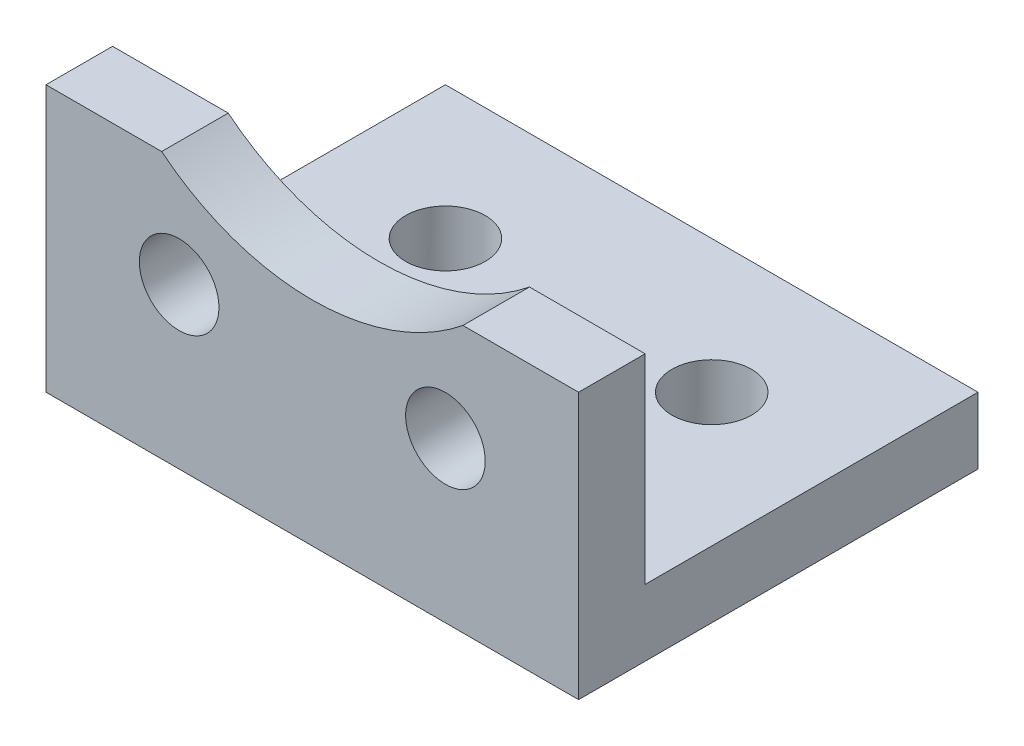
ISO-10303-21;
HEADER;
FILE_DESCRIPTION(('STEP AP214'),'2;1');
FILE_NAME('part.step','',(''),(''),'','','');
FILE_SCHEMA(('AUTOMOTIVE_DESIGN { 1 0 10303 214 1 1 1 1 }'));
ENDSEC;
DATA;
#1=APPLICATION_CONTEXT('core data for automotive mechanical design processes');
#2=APPLICATION_PROTOCOL_DEFINITION('international standard','automotive_design',2000,#1);
#3=PRODUCT_CONTEXT('',#1,'mechanical');
#4=PRODUCT('Part','Part','',(#3));
#5=PRODUCT_RELATED_PRODUCT_CATEGORY('part','',(#4));
#6=PRODUCT_DEFINITION_FORMATION('','',#4);
#7=PRODUCT_DEFINITION_CONTEXT('part definition',#1,'design');
#8=PRODUCT_DEFINITION('design','',#6,#7);
#9=PRODUCT_DEFINITION_SHAPE('','',#8);
#10=(LENGTH_UNIT() NAMED_UNIT(*) SI_UNIT(.MILLI.,.METRE.));
#11=(NAMED_UNIT(*) PLANE_ANGLE_UNIT() SI_UNIT($,.RADIAN.));
#12=(NAMED_UNIT(*) SI_UNIT($,.STERADIAN.) SOLID_ANGLE_UNIT());
#13=UNCERTAINTY_MEASURE_WITH_UNIT(LENGTH_MEASURE(1.E-05),#10,'distance_accuracy_value','');
#14=(GEOMETRIC_REPRESENTATION_CONTEXT(3) GLOBAL_UNCERTAINTY_ASSIGNED_CONTEXT((#13)) GLOBAL_UNIT_ASSIGNED_CONTEXT((#10,
#11,#12)) REPRESENTATION_CONTEXT('',''));
#15=CARTESIAN_POINT('',(0.,0.,0.));
#16=DIRECTION('',(0.,0.,1.));
#17=DIRECTION('',(1.,0.,0.));
#18=AXIS2_PLACEMENT_3D('',#15,#16,#17);
#19=CARTESIAN_POINT('',(12.7,12.7,0.));
#20=DIRECTION('',(0.,1.,0.));
#21=DIRECTION('',(0.,0.,1.));
#22=AXIS2_PLACEMENT_3D('',#19,#20,#21);
#23=PLANE('',#22);
#24=DIRECTION('',(0.,0.,-1.));
#25=VECTOR('',#24,1.);
#26=CARTESIAN_POINT('',(7.18420489685532,12.7,0.));
#27=LINE('',#26,#25);
#28=CARTESIAN_POINT('',(7.18420489685532,12.7,0.));
#29=VERTEX_POINT('',#28);
#30=CARTESIAN_POINT('',(7.18420489685532,12.7,-3.175));
#31=VERTEX_POINT('',#30);
#32=EDGE_CURVE('E100',#29,#31,#27,.T.);
#33=ORIENTED_EDGE('',*,*,#32,.F.);
#34=DIRECTION('',(-1.,0.,0.));
#35=VECTOR('',#34,1.);
#36=CARTESIAN_POINT('',(12.7,12.7,0.));
#37=LINE('',#36,#35);
#38=CARTESIAN_POINT('',(12.7,12.7,0.));
#39=VERTEX_POINT('',#38);
#40=EDGE_CURVE('E110',#39,#29,#37,.T.);
#41=ORIENTED_EDGE('',*,*,#40,.F.);
#42=DIRECTION('',(0.,0.,-1.));
#43=VECTOR('',#42,1.);
#44=CARTESIAN_POINT('',(12.7,12.7,0.));
#45=LINE('',#44,#43);
#46=CARTESIAN_POINT('',(12.7,12.7,-3.175));
#47=VERTEX_POINT('',#46);
#48=EDGE_CURVE('E164',#39,#47,#45,.T.);
#49=ORIENTED_EDGE('',*,*,#48,.T.);
#50=DIRECTION('',(-1.,0.,0.));
#51=VECTOR('',#50,1.);
#52=CARTESIAN_POINT('',(12.7,12.7,-3.175));
#53=LINE('',#52,#51);
#54=EDGE_CURVE('E112',#47,#31,#53,.T.);
#55=ORIENTED_EDGE('',*,*,#54,.T.);
#56=EDGE_LOOP('',(#33,#41,#49,#55));
#57=FACE_BOUND('',#56,.T.);
#58=ADVANCED_FACE('F34',(#57),#23,.T.);
#59=CARTESIAN_POINT('',(12.7,0.,-19.05));
#60=DIRECTION('',(0.,-1.,0.));
#61=DIRECTION('',(0.,0.,-1.));
#62=AXIS2_PLACEMENT_3D('',#59,#60,#61);
#63=PLANE('',#62);
#64=CARTESIAN_POINT('',(6.35,0.,-12.7));
#65=DIRECTION('',(0.,-1.,0.));
#66=DIRECTION('',(0.,0.,-1.));
#67=AXIS2_PLACEMENT_3D('',#64,#65,#66);
#68=CIRCLE('',#67,1.89865);
#69=CARTESIAN_POINT('',(6.35,0.,-14.59865));
#70=VERTEX_POINT('',#69);
#71=EDGE_CURVE('E203',#70,#70,#68,.T.);
#72=ORIENTED_EDGE('',*,*,#71,.F.);
#73=EDGE_LOOP('',(#72));
#74=FACE_BOUND('',#73,.T.);
#75=CARTESIAN_POINT('',(-6.35,0.,-12.7));
#76=DIRECTION('',(0.,-1.,0.));
#77=DIRECTION('',(0.,0.,-1.));
#78=AXIS2_PLACEMENT_3D('',#75,#76,#77);
#79=CIRCLE('',#78,1.89865);
#80=CARTESIAN_POINT('',(-6.35,0.,-14.59865));
#81=VERTEX_POINT('',#80);
#82=EDGE_CURVE('E138',#81,#81,#79,.T.);
#83=ORIENTED_EDGE('',*,*,#82,.F.);
#84=EDGE_LOOP('',(#83));
#85=FACE_BOUND('',#84,.T.);
#86=DIRECTION('',(-1.,0.,0.));
#87=VECTOR('',#86,1.);
#88=CARTESIAN_POINT('',(12.7,0.,0.));
#89=LINE('',#88,#87);
#90=CARTESIAN_POINT('',(12.7,0.,0.));
#91=VERTEX_POINT('',#90);
#92=CARTESIAN_POINT('',(-12.7,0.,0.));
#93=VERTEX_POINT('',#92);
#94=EDGE_CURVE('E124',#91,#93,#89,.T.);
#95=ORIENTED_EDGE('',*,*,#94,.T.);
#96=DIRECTION('',(0.,0.,1.));
#97=VECTOR('',#96,1.);
#98=CARTESIAN_POINT('',(-12.7,0.,-19.05));
#99=LINE('',#98,#97);
#100=CARTESIAN_POINT('',(-12.7,0.,-19.05));
#101=VERTEX_POINT('',#100);
#102=EDGE_CURVE('E130',#101,#93,#99,.T.);
#103=ORIENTED_EDGE('',*,*,#102,.F.);
#104=DIRECTION('',(-1.,0.,0.));
#105=VECTOR('',#104,1.);
#106=CARTESIAN_POINT('',(12.7,0.,-19.05));
#107=LINE('',#106,#105);
#108=CARTESIAN_POINT('',(12.7,0.,-19.05));
#109=VERTEX_POINT('',#108);
#110=EDGE_CURVE('E11',#109,#101,#107,.T.);
#111=ORIENTED_EDGE('',*,*,#110,.F.);
#112=DIRECTION('',(0.,0.,1.));
#113=VECTOR('',#112,1.);
#114=CARTESIAN_POINT('',(12.7,0.,-19.05));
#115=LINE('',#114,#113);
#116=EDGE_CURVE('E161',#109,#91,#115,.T.);
#117=ORIENTED_EDGE('',*,*,#116,.T.);
#118=EDGE_LOOP('',(#95,#103,#111,#117));
#119=FACE_BOUND('',#118,.T.);
#120=ADVANCED_FACE('F36',(#74,#85,#119),#63,.T.);
#121=CARTESIAN_POINT('',(12.7,3.175,-19.05));
#122=DIRECTION('',(0.,0.,-1.));
#123=DIRECTION('',(-1.,0.,0.));
#124=AXIS2_PLACEMENT_3D('',#121,#122,#123);
#125=PLANE('',#124);
#126=ORIENTED_EDGE('',*,*,#110,.T.);
#127=DIRECTION('',(0.,-1.,0.));
#128=VECTOR('',#127,1.);
#129=CARTESIAN_POINT('',(-12.7,3.175,-19.05));
#130=LINE('',#129,#128);
#131=CARTESIAN_POINT('',(-12.7,3.175,-19.05));
#132=VERTEX_POINT('',#131);
#133=EDGE_CURVE('E158',#132,#101,#130,.T.);
#134=ORIENTED_EDGE('',*,*,#133,.F.);
#135=DIRECTION('',(-1.,0.,0.));
#136=VECTOR('',#135,1.);
#137=CARTESIAN_POINT('',(12.7,3.175,-19.05));
#138=LINE('',#137,#136);
#139=CARTESIAN_POINT('',(12.7,3.175,-19.05));
#140=VERTEX_POINT('',#139);
#141=EDGE_CURVE('E43',#140,#132,#138,.T.);
#142=ORIENTED_EDGE('',*,*,#141,.F.);
#143=DIRECTION('',(0.,-1.,0.));
#144=VECTOR('',#143,1.);
#145=CARTESIAN_POINT('',(12.7,3.175,-19.05));
#146=LINE('',#145,#144);
#147=EDGE_CURVE('E127',#140,#109,#146,.T.);
#148=ORIENTED_EDGE('',*,*,#147,.T.);
#149=EDGE_LOOP('',(#126,#134,#142,#148));
#150=FACE_BOUND('',#149,.T.);
#151=ADVANCED_FACE('F191',(#150),#125,.T.);
#152=CARTESIAN_POINT('',(12.7,3.175,-3.175));
#153=DIRECTION('',(0.,1.,0.));
#154=DIRECTION('',(0.,0.,1.));
#155=AXIS2_PLACEMENT_3D('',#152,#153,#154);
#156=PLANE('',#155);
#157=CARTESIAN_POINT('',(6.35,3.175,-12.7));
#158=DIRECTION('',(0.,1.,0.));
#159=DIRECTION('',(0.,0.,1.));
#160=AXIS2_PLACEMENT_3D('',#157,#158,#159);
#161=CIRCLE('',#160,1.89865);
#162=CARTESIAN_POINT('',(6.35,3.175,-10.80135));
#163=VERTEX_POINT('',#162);
#164=EDGE_CURVE('E200',#163,#163,#161,.T.);
#165=ORIENTED_EDGE('',*,*,#164,.F.);
#166=EDGE_LOOP('',(#165));
#167=FACE_BOUND('',#166,.T.);
#168=CARTESIAN_POINT('',(-6.35,3.175,-12.7));
#169=DIRECTION('',(0.,1.,0.));
#170=DIRECTION('',(0.,0.,1.));
#171=AXIS2_PLACEMENT_3D('',#168,#169,#170);
#172=CIRCLE('',#171,1.89865);
#173=CARTESIAN_POINT('',(-6.35,3.175,-10.80135));
#174=VERTEX_POINT('',#173);
#175=EDGE_CURVE('E143',#174,#174,#172,.T.);
#176=ORIENTED_EDGE('',*,*,#175,.F.);
#177=EDGE_LOOP('',(#176));
#178=FACE_BOUND('',#177,.T.);
#179=ORIENTED_EDGE('',*,*,#141,.T.);
#180=DIRECTION('',(0.,0.,-1.));
#181=VECTOR('',#180,1.);
#182=CARTESIAN_POINT('',(-12.7,3.175,-3.175));
#183=LINE('',#182,#181);
#184=CARTESIAN_POINT('',(-12.7,3.175,-3.175));
#185=VERTEX_POINT('',#184);
#186=EDGE_CURVE('E155',#185,#132,#183,.T.);
#187=ORIENTED_EDGE('',*,*,#186,.F.);
#188=DIRECTION('',(-1.,0.,0.));
#189=VECTOR('',#188,1.);
#190=CARTESIAN_POINT('',(12.7,3.175,-3.175));
#191=LINE('',#190,#189);
#192=CARTESIAN_POINT('',(12.7,3.175,-3.175));
#193=VERTEX_POINT('',#192);
#194=EDGE_CURVE('E174',#193,#185,#191,.T.);
#195=ORIENTED_EDGE('',*,*,#194,.F.);
#196=DIRECTION('',(0.,0.,-1.));
#197=VECTOR('',#196,1.);
#198=CARTESIAN_POINT('',(12.7,3.175,-3.175));
#199=LINE('',#198,#197);
#200=EDGE_CURVE('E169',#193,#140,#199,.T.);
#201=ORIENTED_EDGE('',*,*,#200,.T.);
#202=EDGE_LOOP('',(#179,#187,#195,#201));
#203=FACE_BOUND('',#202,.T.);
#204=ADVANCED_FACE('F188',(#167,#178,#203),#156,.T.);
#205=CARTESIAN_POINT('',(12.7,12.7,-3.175));
#206=DIRECTION('',(0.,0.,-1.));
#207=DIRECTION('',(0.,1.,0.));
#208=AXIS2_PLACEMENT_3D('',#205,#206,#207);
#209=PLANE('',#208);
#210=CARTESIAN_POINT('',(0.,21.59,-3.175));
#211=DIRECTION('',(0.,0.,-1.));
#212=DIRECTION('',(0.,1.,0.));
#213=AXIS2_PLACEMENT_3D('',#210,#211,#212);
#214=CIRCLE('',#213,11.43);
#215=CARTESIAN_POINT('',(-7.18420489685532,12.7,-3.175));
#216=VERTEX_POINT('',#215);
#217=EDGE_CURVE('E105',#31,#216,#214,.T.);
#218=ORIENTED_EDGE('',*,*,#217,.F.);
#219=ORIENTED_EDGE('',*,*,#54,.F.);
#220=DIRECTION('',(0.,-1.,0.));
#221=VECTOR('',#220,1.);
#222=CARTESIAN_POINT('',(12.7,12.7,-3.175));
#223=LINE('',#222,#221);
#224=EDGE_CURVE('E166',#47,#193,#223,.T.);
#225=ORIENTED_EDGE('',*,*,#224,.T.);
#226=ORIENTED_EDGE('',*,*,#194,.T.);
#227=DIRECTION('',(0.,-1.,0.));
#228=VECTOR('',#227,1.);
#229=CARTESIAN_POINT('',(-12.7,12.7,-3.175));
#230=LINE('',#229,#228);
#231=CARTESIAN_POINT('',(-12.7,12.7,-3.175));
#232=VERTEX_POINT('',#231);
#233=EDGE_CURVE('E152',#232,#185,#230,.T.);
#234=ORIENTED_EDGE('',*,*,#233,.F.);
#235=EDGE_CURVE('E120',#216,#232,#53,.T.);
#236=ORIENTED_EDGE('',*,*,#235,.F.);
#237=EDGE_LOOP('',(#218,#219,#225,#226,#234,#236));
#238=FACE_BOUND('',#237,.T.);
#239=CARTESIAN_POINT('',(6.35,7.62,-3.175));
#240=DIRECTION('',(0.,0.,-1.));
#241=DIRECTION('',(0.,1.,0.));
#242=AXIS2_PLACEMENT_3D('',#239,#240,#241);
#243=CIRCLE('',#242,1.89865);
#244=CARTESIAN_POINT('',(6.35,9.51865,-3.175));
#245=VERTEX_POINT('',#244);
#246=EDGE_CURVE('E113',#245,#245,#243,.T.);
#247=ORIENTED_EDGE('',*,*,#246,.F.);
#248=EDGE_LOOP('',(#247));
#249=FACE_BOUND('',#248,.T.);
#250=CARTESIAN_POINT('',(-6.35,7.62,-3.175));
#251=DIRECTION('',(0.,0.,-1.));
#252=DIRECTION('',(0.,1.,0.));
#253=AXIS2_PLACEMENT_3D('',#250,#251,#252);
#254=CIRCLE('',#253,1.89865);
#255=CARTESIAN_POINT('',(-6.35,9.51865,-3.175));
#256=VERTEX_POINT('',#255);
#257=EDGE_CURVE('E131',#256,#256,#254,.T.);
#258=ORIENTED_EDGE('',*,*,#257,.F.);
#259=EDGE_LOOP('',(#258));
#260=FACE_BOUND('',#259,.T.);
#261=ADVANCED_FACE('F177',(#238,#249,#260),#209,.T.);
#262=DIRECTION('',(0.,0.,-1.));
#263=VECTOR('',#262,1.);
#264=CARTESIAN_POINT('',(-7.18420489685532,12.7,0.));
#265=LINE('',#264,#263);
#266=CARTESIAN_POINT('',(-7.18420489685532,12.7,0.));
#267=VERTEX_POINT('',#266);
#268=EDGE_CURVE('E51',#216,#267,#265,.F.);
#269=ORIENTED_EDGE('',*,*,#268,.F.);
#270=ORIENTED_EDGE('',*,*,#235,.T.);
#271=DIRECTION('',(0.,0.,-1.));
#272=VECTOR('',#271,1.);
#273=CARTESIAN_POINT('',(-12.7,12.7,0.));
#274=LINE('',#273,#272);
#275=CARTESIAN_POINT('',(-12.7,12.7,0.));
#276=VERTEX_POINT('',#275);
#277=EDGE_CURVE('E149',#276,#232,#274,.T.);
#278=ORIENTED_EDGE('',*,*,#277,.F.);
#279=EDGE_CURVE('E121',#267,#276,#37,.T.);
#280=ORIENTED_EDGE('',*,*,#279,.F.);
#281=EDGE_LOOP('',(#269,#270,#278,#280));
#282=FACE_BOUND('',#281,.T.);
#283=ADVANCED_FACE('F194',(#282),#23,.T.);
#284=CARTESIAN_POINT('',(12.7,0.,0.));
#285=DIRECTION('',(0.,0.,1.));
#286=DIRECTION('',(1.,0.,0.));
#287=AXIS2_PLACEMENT_3D('',#284,#285,#286);
#288=PLANE('',#287);
#289=CARTESIAN_POINT('',(0.,21.59,0.));
#290=DIRECTION('',(0.,0.,-1.));
#291=DIRECTION('',(0.,1.,0.));
#292=AXIS2_PLACEMENT_3D('',#289,#290,#291);
#293=CIRCLE('',#292,11.43);
#294=EDGE_CURVE('E97',#29,#267,#293,.T.);
#295=ORIENTED_EDGE('',*,*,#294,.T.);
#296=ORIENTED_EDGE('',*,*,#279,.T.);
#297=DIRECTION('',(0.,1.,0.));
#298=VECTOR('',#297,1.);
#299=CARTESIAN_POINT('',(-12.7,0.,0.));
#300=LINE('',#299,#298);
#301=EDGE_CURVE('E135',#93,#276,#300,.T.);
#302=ORIENTED_EDGE('',*,*,#301,.F.);
#303=ORIENTED_EDGE('',*,*,#94,.F.);
#304=DIRECTION('',(0.,1.,0.));
#305=VECTOR('',#304,1.);
#306=CARTESIAN_POINT('',(12.7,0.,0.));
#307=LINE('',#306,#305);
#308=EDGE_CURVE('E119',#91,#39,#307,.T.);
#309=ORIENTED_EDGE('',*,*,#308,.T.);
#310=ORIENTED_EDGE('',*,*,#40,.T.);
#311=EDGE_LOOP('',(#295,#296,#302,#303,#309,#310));
#312=FACE_BOUND('',#311,.T.);
#313=CARTESIAN_POINT('',(6.35,7.62,0.));
#314=DIRECTION('',(0.,0.,1.));
#315=DIRECTION('',(1.,0.,0.));
#316=AXIS2_PLACEMENT_3D('',#313,#314,#315);
#317=CIRCLE('',#316,1.89865);
#318=CARTESIAN_POINT('',(8.24865,7.62,0.));
#319=VERTEX_POINT('',#318);
#320=EDGE_CURVE('E38',#319,#319,#317,.T.);
#321=ORIENTED_EDGE('',*,*,#320,.F.);
#322=EDGE_LOOP('',(#321));
#323=FACE_BOUND('',#322,.T.);
#324=CARTESIAN_POINT('',(-6.35,7.62,0.));
#325=DIRECTION('',(0.,0.,1.));
#326=DIRECTION('',(1.,0.,0.));
#327=AXIS2_PLACEMENT_3D('',#324,#325,#326);
#328=CIRCLE('',#327,1.89865);
#329=CARTESIAN_POINT('',(-4.45135,7.62,0.));
#330=VERTEX_POINT('',#329);
#331=EDGE_CURVE('E128',#330,#330,#328,.T.);
#332=ORIENTED_EDGE('',*,*,#331,.F.);
#333=EDGE_LOOP('',(#332));
#334=FACE_BOUND('',#333,.T.);
#335=ADVANCED_FACE('F116',(#312,#323,#334),#288,.T.);
#336=CARTESIAN_POINT('',(12.7,0.,0.));
#337=DIRECTION('',(-1.,0.,0.));
#338=DIRECTION('',(0.,0.,1.));
#339=AXIS2_PLACEMENT_3D('',#336,#337,#338);
#340=PLANE('',#339);
#341=ORIENTED_EDGE('',*,*,#116,.F.);
#342=ORIENTED_EDGE('',*,*,#147,.F.);
#343=ORIENTED_EDGE('',*,*,#200,.F.);
#344=ORIENTED_EDGE('',*,*,#224,.F.);
#345=ORIENTED_EDGE('',*,*,#48,.F.);
#346=ORIENTED_EDGE('',*,*,#308,.F.);
#347=EDGE_LOOP('',(#341,#342,#343,#344,#345,#346));
#348=FACE_BOUND('',#347,.T.);
#349=ADVANCED_FACE('F230',(#348),#340,.F.);
#350=CARTESIAN_POINT('',(-12.7,0.,0.));
#351=DIRECTION('',(-1.,0.,0.));
#352=DIRECTION('',(0.,0.,1.));
#353=AXIS2_PLACEMENT_3D('',#350,#351,#352);
#354=PLANE('',#353);
#355=ORIENTED_EDGE('',*,*,#102,.T.);
#356=ORIENTED_EDGE('',*,*,#301,.T.);
#357=ORIENTED_EDGE('',*,*,#277,.T.);
#358=ORIENTED_EDGE('',*,*,#233,.T.);
#359=ORIENTED_EDGE('',*,*,#186,.T.);
#360=ORIENTED_EDGE('',*,*,#133,.T.);
#361=EDGE_LOOP('',(#355,#356,#357,#358,#359,#360));
#362=FACE_BOUND('',#361,.T.);
#363=ADVANCED_FACE('F185',(#362),#354,.T.);
#364=CARTESIAN_POINT('',(-6.35,7.62,-3.175));
#365=DIRECTION('',(0.,0.,-1.));
#366=DIRECTION('',(0.,1.,0.));
#367=AXIS2_PLACEMENT_3D('',#364,#365,#366);
#368=CYLINDRICAL_SURFACE('',#367,1.89865);
#369=ORIENTED_EDGE('',*,*,#331,.T.);
#370=EDGE_LOOP('',(#369));
#371=FACE_BOUND('',#370,.T.);
#372=ORIENTED_EDGE('',*,*,#257,.T.);
#373=EDGE_LOOP('',(#372));
#374=FACE_BOUND('',#373,.T.);
#375=ADVANCED_FACE('F239',(#371,#374),#368,.F.);
#376=CARTESIAN_POINT('',(-6.35,3.175,-12.7));
#377=DIRECTION('',(0.,1.,0.));
#378=DIRECTION('',(0.,0.,1.));
#379=AXIS2_PLACEMENT_3D('',#376,#377,#378);
#380=CYLINDRICAL_SURFACE('',#379,1.89865);
#381=ORIENTED_EDGE('',*,*,#82,.T.);
#382=EDGE_LOOP('',(#381));
#383=FACE_BOUND('',#382,.T.);
#384=ORIENTED_EDGE('',*,*,#175,.T.);
#385=EDGE_LOOP('',(#384));
#386=FACE_BOUND('',#385,.T.);
#387=ADVANCED_FACE('F208',(#383,#386),#380,.F.);
#388=CARTESIAN_POINT('',(6.35,3.175,-12.7));
#389=DIRECTION('',(0.,1.,0.));
#390=DIRECTION('',(0.,0.,1.));
#391=AXIS2_PLACEMENT_3D('',#388,#389,#390);
#392=CYLINDRICAL_SURFACE('',#391,1.89865);
#393=ORIENTED_EDGE('',*,*,#71,.T.);
#394=EDGE_LOOP('',(#393));
#395=FACE_BOUND('',#394,.T.);
#396=ORIENTED_EDGE('',*,*,#164,.T.);
#397=EDGE_LOOP('',(#396));
#398=FACE_BOUND('',#397,.T.);
#399=ADVANCED_FACE('F246',(#395,#398),#392,.F.);
#400=CARTESIAN_POINT('',(6.35,7.62,-3.175));
#401=DIRECTION('',(0.,0.,-1.));
#402=DIRECTION('',(0.,1.,0.));
#403=AXIS2_PLACEMENT_3D('',#400,#401,#402);
#404=CYLINDRICAL_SURFACE('',#403,1.89865);
#405=ORIENTED_EDGE('',*,*,#320,.T.);
#406=EDGE_LOOP('',(#405));
#407=FACE_BOUND('',#406,.T.);
#408=ORIENTED_EDGE('',*,*,#246,.T.);
#409=EDGE_LOOP('',(#408));
#410=FACE_BOUND('',#409,.T.);
#411=ADVANCED_FACE('F250',(#407,#410),#404,.F.);
#412=CARTESIAN_POINT('',(0.,21.59,0.));
#413=DIRECTION('',(0.,0.,-1.));
#414=DIRECTION('',(0.,1.,0.));
#415=AXIS2_PLACEMENT_3D('',#412,#413,#414);
#416=CYLINDRICAL_SURFACE('',#415,11.43);
#417=ORIENTED_EDGE('',*,*,#32,.T.);
#418=ORIENTED_EDGE('',*,*,#217,.T.);
#419=ORIENTED_EDGE('',*,*,#268,.T.);
#420=ORIENTED_EDGE('',*,*,#294,.F.);
#421=EDGE_LOOP('',(#417,#418,#419,#420));
#422=FACE_BOUND('',#421,.T.);
#423=ADVANCED_FACE('F99',(#422),#416,.F.);
#424=CLOSED_SHELL('',(#58,#120,#151,#204,#261,#283,#335,#349,#363,#375,#387,#399,#411,#423));
#425=MANIFOLD_SOLID_BREP('B2',#424);
#426=ADVANCED_BREP_SHAPE_REPRESENTATION('',(#18,#425),#14);
#427=SHAPE_DEFINITION_REPRESENTATION(#9,#426);
ENDSEC;
END-ISO-10303-21;
